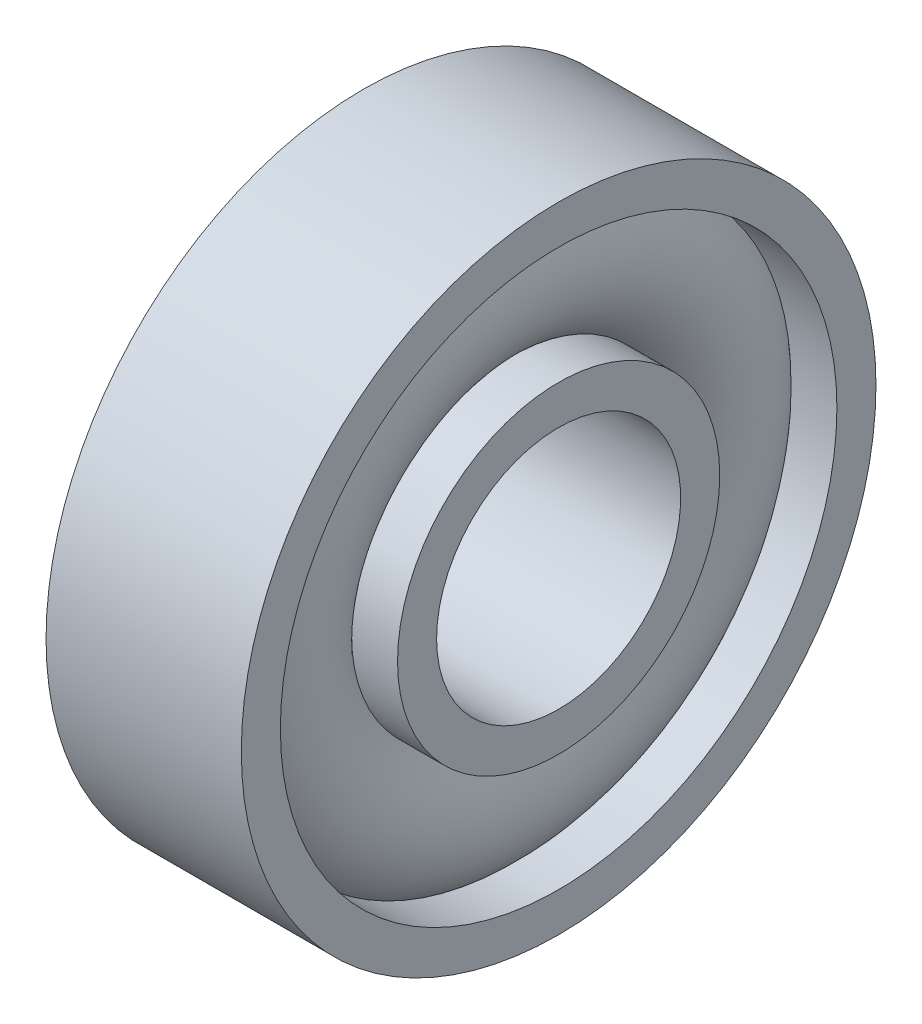
ISO-10303-21;
HEADER;
FILE_DESCRIPTION(('STEP AP214'),'2;1');
FILE_NAME('part.step','',(''),(''),'','','');
FILE_SCHEMA(('AUTOMOTIVE_DESIGN { 1 0 10303 214 1 1 1 1 }'));
ENDSEC;
DATA;
#1=APPLICATION_CONTEXT('core data for automotive mechanical design processes');
#2=APPLICATION_PROTOCOL_DEFINITION('international standard','automotive_design',2000,#1);
#3=PRODUCT_CONTEXT('',#1,'mechanical');
#4=PRODUCT('Part','Part','',(#3));
#5=PRODUCT_RELATED_PRODUCT_CATEGORY('part','',(#4));
#6=PRODUCT_DEFINITION_FORMATION('','',#4);
#7=PRODUCT_DEFINITION_CONTEXT('part definition',#1,'design');
#8=PRODUCT_DEFINITION('design','',#6,#7);
#9=PRODUCT_DEFINITION_SHAPE('','',#8);
#10=(LENGTH_UNIT() NAMED_UNIT(*) SI_UNIT(.MILLI.,.METRE.));
#11=(NAMED_UNIT(*) PLANE_ANGLE_UNIT() SI_UNIT($,.RADIAN.));
#12=(NAMED_UNIT(*) SI_UNIT($,.STERADIAN.) SOLID_ANGLE_UNIT());
#13=UNCERTAINTY_MEASURE_WITH_UNIT(LENGTH_MEASURE(1.E-05),#10,'distance_accuracy_value','');
#14=(GEOMETRIC_REPRESENTATION_CONTEXT(3) GLOBAL_UNCERTAINTY_ASSIGNED_CONTEXT((#13)) GLOBAL_UNIT_ASSIGNED_CONTEXT((#10,
#11,#12)) REPRESENTATION_CONTEXT('',''));
#15=CARTESIAN_POINT('',(0.,0.,0.));
#16=DIRECTION('',(0.,0.,1.));
#17=DIRECTION('',(1.,0.,0.));
#18=AXIS2_PLACEMENT_3D('',#15,#16,#17);
#19=CARTESIAN_POINT('',(2.,6.5,0.));
#20=DIRECTION('',(-1.,0.,0.));
#21=DIRECTION('',(0.,0.,1.));
#22=AXIS2_PLACEMENT_3D('',#19,#20,#21);
#23=PLANE('',#22);
#24=CARTESIAN_POINT('',(2.,0.,0.));
#25=DIRECTION('',(-1.,0.,0.));
#26=DIRECTION('',(0.,0.,1.));
#27=AXIS2_PLACEMENT_3D('',#24,#25,#26);
#28=CIRCLE('',#27,6.5);
#29=CARTESIAN_POINT('',(2.,0.,6.5));
#30=VERTEX_POINT('',#29);
#31=EDGE_CURVE('E70',#30,#30,#28,.T.);
#32=ORIENTED_EDGE('',*,*,#31,.F.);
#33=EDGE_LOOP('',(#32));
#34=FACE_BOUND('',#33,.T.);
#35=CARTESIAN_POINT('',(2.,0.,0.));
#36=DIRECTION('',(-1.,0.,0.));
#37=DIRECTION('',(0.,0.,1.));
#38=AXIS2_PLACEMENT_3D('',#35,#36,#37);
#39=CIRCLE('',#38,5.7);
#40=CARTESIAN_POINT('',(2.,0.,5.7));
#41=VERTEX_POINT('',#40);
#42=EDGE_CURVE('E10',#41,#41,#39,.T.);
#43=ORIENTED_EDGE('',*,*,#42,.T.);
#44=EDGE_LOOP('',(#43));
#45=FACE_BOUND('',#44,.T.);
#46=ADVANCED_FACE('F30',(#34,#45),#23,.F.);
#47=CARTESIAN_POINT('',(-3.50151098007079,0.,0.));
#48=DIRECTION('',(-1.,0.,0.));
#49=DIRECTION('',(0.,0.,1.));
#50=AXIS2_PLACEMENT_3D('',#47,#48,#49);
#51=CYLINDRICAL_SURFACE('',#50,5.7);
#52=ORIENTED_EDGE('',*,*,#42,.F.);
#53=EDGE_LOOP('',(#52));
#54=FACE_BOUND('',#53,.T.);
#55=CARTESIAN_POINT('',(1.05830052442584,0.,0.));
#56=DIRECTION('',(-1.,0.,0.));
#57=DIRECTION('',(0.,0.,1.));
#58=AXIS2_PLACEMENT_3D('',#55,#56,#57);
#59=CIRCLE('',#58,5.7);
#60=CARTESIAN_POINT('',(1.05830052442584,0.,5.7));
#61=VERTEX_POINT('',#60);
#62=EDGE_CURVE('E36',#61,#61,#59,.T.);
#63=ORIENTED_EDGE('',*,*,#62,.T.);
#64=EDGE_LOOP('',(#63));
#65=FACE_BOUND('',#64,.T.);
#66=ADVANCED_FACE('F77',(#54,#65),#51,.F.);
#67=CARTESIAN_POINT('',(0.,0.,0.));
#68=DIRECTION('',(-1.,0.,0.));
#69=DIRECTION('',(0.,0.,1.));
#70=AXIS2_PLACEMENT_3D('',#67,#68,#69);
#71=TOROIDAL_SURFACE('',#70,4.5,1.6);
#72=ORIENTED_EDGE('',*,*,#62,.F.);
#73=EDGE_LOOP('',(#72));
#74=FACE_BOUND('',#73,.T.);
#75=CARTESIAN_POINT('',(1.05830052442584,0.,0.));
#76=DIRECTION('',(-1.,0.,0.));
#77=DIRECTION('',(0.,0.,1.));
#78=AXIS2_PLACEMENT_3D('',#75,#76,#77);
#79=CIRCLE('',#78,3.3);
#80=CARTESIAN_POINT('',(1.05830052442584,0.,3.3));
#81=VERTEX_POINT('',#80);
#82=EDGE_CURVE('E40',#81,#81,#79,.T.);
#83=ORIENTED_EDGE('',*,*,#82,.T.);
#84=EDGE_LOOP('',(#83));
#85=FACE_BOUND('',#84,.T.);
#86=ADVANCED_FACE('F81',(#74,#85),#71,.T.);
#87=CARTESIAN_POINT('',(-3.50151098007079,0.,0.));
#88=DIRECTION('',(-1.,0.,0.));
#89=DIRECTION('',(0.,0.,1.));
#90=AXIS2_PLACEMENT_3D('',#87,#88,#89);
#91=CYLINDRICAL_SURFACE('',#90,3.3);
#92=ORIENTED_EDGE('',*,*,#82,.F.);
#93=EDGE_LOOP('',(#92));
#94=FACE_BOUND('',#93,.T.);
#95=CARTESIAN_POINT('',(2.,0.,0.));
#96=DIRECTION('',(-1.,0.,0.));
#97=DIRECTION('',(0.,0.,1.));
#98=AXIS2_PLACEMENT_3D('',#95,#96,#97);
#99=CIRCLE('',#98,3.3);
#100=CARTESIAN_POINT('',(2.,0.,3.3));
#101=VERTEX_POINT('',#100);
#102=EDGE_CURVE('E44',#101,#101,#99,.T.);
#103=ORIENTED_EDGE('',*,*,#102,.T.);
#104=EDGE_LOOP('',(#103));
#105=FACE_BOUND('',#104,.T.);
#106=ADVANCED_FACE('F86',(#94,#105),#91,.T.);
#107=CARTESIAN_POINT('',(2.,3.3,0.));
#108=DIRECTION('',(-1.,0.,0.));
#109=DIRECTION('',(0.,0.,1.));
#110=AXIS2_PLACEMENT_3D('',#107,#108,#109);
#111=PLANE('',#110);
#112=ORIENTED_EDGE('',*,*,#102,.F.);
#113=EDGE_LOOP('',(#112));
#114=FACE_BOUND('',#113,.T.);
#115=CARTESIAN_POINT('',(2.,0.,0.));
#116=DIRECTION('',(-1.,0.,0.));
#117=DIRECTION('',(0.,0.,1.));
#118=AXIS2_PLACEMENT_3D('',#115,#116,#117);
#119=CIRCLE('',#118,2.5);
#120=CARTESIAN_POINT('',(2.,0.,2.5));
#121=VERTEX_POINT('',#120);
#122=EDGE_CURVE('E49',#121,#121,#119,.T.);
#123=ORIENTED_EDGE('',*,*,#122,.T.);
#124=EDGE_LOOP('',(#123));
#125=FACE_BOUND('',#124,.T.);
#126=ADVANCED_FACE('F92',(#114,#125),#111,.F.);
#127=CARTESIAN_POINT('',(-3.50151098007079,0.,0.));
#128=DIRECTION('',(-1.,0.,0.));
#129=DIRECTION('',(0.,0.,1.));
#130=AXIS2_PLACEMENT_3D('',#127,#128,#129);
#131=CYLINDRICAL_SURFACE('',#130,2.5);
#132=ORIENTED_EDGE('',*,*,#122,.F.);
#133=EDGE_LOOP('',(#132));
#134=FACE_BOUND('',#133,.T.);
#135=CARTESIAN_POINT('',(-2.,0.,0.));
#136=DIRECTION('',(-1.,0.,0.));
#137=DIRECTION('',(0.,0.,1.));
#138=AXIS2_PLACEMENT_3D('',#135,#136,#137);
#139=CIRCLE('',#138,2.5);
#140=CARTESIAN_POINT('',(-2.,0.,2.5));
#141=VERTEX_POINT('',#140);
#142=EDGE_CURVE('E52',#141,#141,#139,.T.);
#143=ORIENTED_EDGE('',*,*,#142,.T.);
#144=EDGE_LOOP('',(#143));
#145=FACE_BOUND('',#144,.T.);
#146=ADVANCED_FACE('F96',(#134,#145),#131,.F.);
#147=CARTESIAN_POINT('',(-2.,3.3,0.));
#148=DIRECTION('',(1.,0.,0.));
#149=DIRECTION('',(0.,0.,-1.));
#150=AXIS2_PLACEMENT_3D('',#147,#148,#149);
#151=PLANE('',#150);
#152=ORIENTED_EDGE('',*,*,#142,.F.);
#153=EDGE_LOOP('',(#152));
#154=FACE_BOUND('',#153,.T.);
#155=CARTESIAN_POINT('',(-2.,0.,0.));
#156=DIRECTION('',(-1.,0.,0.));
#157=DIRECTION('',(0.,0.,1.));
#158=AXIS2_PLACEMENT_3D('',#155,#156,#157);
#159=CIRCLE('',#158,3.3);
#160=CARTESIAN_POINT('',(-2.,0.,3.3));
#161=VERTEX_POINT('',#160);
#162=EDGE_CURVE('E55',#161,#161,#159,.T.);
#163=ORIENTED_EDGE('',*,*,#162,.T.);
#164=EDGE_LOOP('',(#163));
#165=FACE_BOUND('',#164,.T.);
#166=ADVANCED_FACE('F100',(#154,#165),#151,.F.);
#167=CARTESIAN_POINT('',(-3.50151098007079,0.,0.));
#168=DIRECTION('',(-1.,0.,0.));
#169=DIRECTION('',(0.,0.,1.));
#170=AXIS2_PLACEMENT_3D('',#167,#168,#169);
#171=CYLINDRICAL_SURFACE('',#170,3.3);
#172=ORIENTED_EDGE('',*,*,#162,.F.);
#173=EDGE_LOOP('',(#172));
#174=FACE_BOUND('',#173,.T.);
#175=CARTESIAN_POINT('',(-1.05830052442584,0.,0.));
#176=DIRECTION('',(-1.,0.,0.));
#177=DIRECTION('',(0.,0.,1.));
#178=AXIS2_PLACEMENT_3D('',#175,#176,#177);
#179=CIRCLE('',#178,3.3);
#180=CARTESIAN_POINT('',(-1.05830052442584,0.,3.3));
#181=VERTEX_POINT('',#180);
#182=EDGE_CURVE('E58',#181,#181,#179,.T.);
#183=ORIENTED_EDGE('',*,*,#182,.T.);
#184=EDGE_LOOP('',(#183));
#185=FACE_BOUND('',#184,.T.);
#186=ADVANCED_FACE('F104',(#174,#185),#171,.T.);
#187=CARTESIAN_POINT('',(0.,0.,0.));
#188=DIRECTION('',(-1.,0.,0.));
#189=DIRECTION('',(0.,0.,1.));
#190=AXIS2_PLACEMENT_3D('',#187,#188,#189);
#191=TOROIDAL_SURFACE('',#190,4.5,1.6);
#192=ORIENTED_EDGE('',*,*,#182,.F.);
#193=EDGE_LOOP('',(#192));
#194=FACE_BOUND('',#193,.T.);
#195=CARTESIAN_POINT('',(-1.05830052442584,0.,0.));
#196=DIRECTION('',(-1.,0.,0.));
#197=DIRECTION('',(0.,0.,1.));
#198=AXIS2_PLACEMENT_3D('',#195,#196,#197);
#199=CIRCLE('',#198,5.7);
#200=CARTESIAN_POINT('',(-1.05830052442584,0.,5.7));
#201=VERTEX_POINT('',#200);
#202=EDGE_CURVE('E61',#201,#201,#199,.T.);
#203=ORIENTED_EDGE('',*,*,#202,.T.);
#204=EDGE_LOOP('',(#203));
#205=FACE_BOUND('',#204,.T.);
#206=ADVANCED_FACE('F108',(#194,#205),#191,.T.);
#207=CARTESIAN_POINT('',(-3.50151098007079,0.,0.));
#208=DIRECTION('',(-1.,0.,0.));
#209=DIRECTION('',(0.,0.,1.));
#210=AXIS2_PLACEMENT_3D('',#207,#208,#209);
#211=CYLINDRICAL_SURFACE('',#210,5.7);
#212=ORIENTED_EDGE('',*,*,#202,.F.);
#213=EDGE_LOOP('',(#212));
#214=FACE_BOUND('',#213,.T.);
#215=CARTESIAN_POINT('',(-2.,0.,0.));
#216=DIRECTION('',(-1.,0.,0.));
#217=DIRECTION('',(0.,0.,1.));
#218=AXIS2_PLACEMENT_3D('',#215,#216,#217);
#219=CIRCLE('',#218,5.7);
#220=CARTESIAN_POINT('',(-2.,0.,5.7));
#221=VERTEX_POINT('',#220);
#222=EDGE_CURVE('E64',#221,#221,#219,.T.);
#223=ORIENTED_EDGE('',*,*,#222,.T.);
#224=EDGE_LOOP('',(#223));
#225=FACE_BOUND('',#224,.T.);
#226=ADVANCED_FACE('F112',(#214,#225),#211,.F.);
#227=CARTESIAN_POINT('',(-2.,6.5,0.));
#228=DIRECTION('',(1.,0.,0.));
#229=DIRECTION('',(0.,0.,-1.));
#230=AXIS2_PLACEMENT_3D('',#227,#228,#229);
#231=PLANE('',#230);
#232=ORIENTED_EDGE('',*,*,#222,.F.);
#233=EDGE_LOOP('',(#232));
#234=FACE_BOUND('',#233,.T.);
#235=CARTESIAN_POINT('',(-2.,0.,0.));
#236=DIRECTION('',(-1.,0.,0.));
#237=DIRECTION('',(0.,0.,1.));
#238=AXIS2_PLACEMENT_3D('',#235,#236,#237);
#239=CIRCLE('',#238,6.5);
#240=CARTESIAN_POINT('',(-2.,0.,6.5));
#241=VERTEX_POINT('',#240);
#242=EDGE_CURVE('E67',#241,#241,#239,.T.);
#243=ORIENTED_EDGE('',*,*,#242,.T.);
#244=EDGE_LOOP('',(#243));
#245=FACE_BOUND('',#244,.T.);
#246=ADVANCED_FACE('F116',(#234,#245),#231,.F.);
#247=CARTESIAN_POINT('',(-3.50151098007079,0.,0.));
#248=DIRECTION('',(-1.,0.,0.));
#249=DIRECTION('',(0.,0.,1.));
#250=AXIS2_PLACEMENT_3D('',#247,#248,#249);
#251=CYLINDRICAL_SURFACE('',#250,6.5);
#252=ORIENTED_EDGE('',*,*,#242,.F.);
#253=EDGE_LOOP('',(#252));
#254=FACE_BOUND('',#253,.T.);
#255=ORIENTED_EDGE('',*,*,#31,.T.);
#256=EDGE_LOOP('',(#255));
#257=FACE_BOUND('',#256,.T.);
#258=ADVANCED_FACE('F74',(#254,#257),#251,.T.);
#259=CLOSED_SHELL('',(#46,#66,#86,#106,#126,#146,#166,#186,#206,#226,#246,#258));
#260=MANIFOLD_SOLID_BREP('B2',#259);
#261=ADVANCED_BREP_SHAPE_REPRESENTATION('',(#18,#260),#14);
#262=SHAPE_DEFINITION_REPRESENTATION(#9,#261);
ENDSEC;
END-ISO-10303-21;
